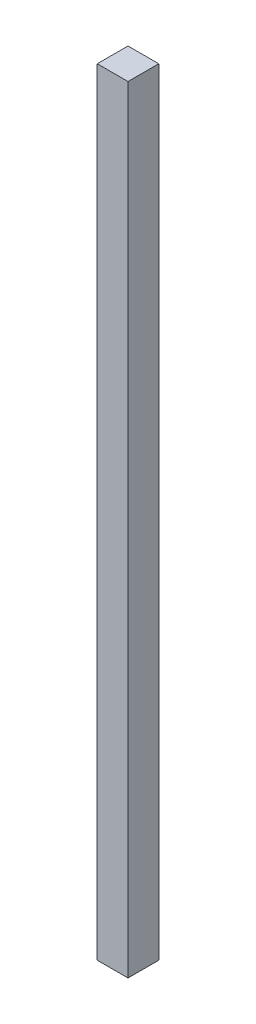
ISO-10303-21;
HEADER;
FILE_DESCRIPTION(('STEP AP214'),'2;1');
FILE_NAME('part.step','',(''),(''),'','','');
FILE_SCHEMA(('AUTOMOTIVE_DESIGN { 1 0 10303 214 1 1 1 1 }'));
ENDSEC;
DATA;
#1=APPLICATION_CONTEXT('core data for automotive mechanical design processes');
#2=APPLICATION_PROTOCOL_DEFINITION('international standard','automotive_design',2000,#1);
#3=PRODUCT_CONTEXT('',#1,'mechanical');
#4=PRODUCT('Part','Part','',(#3));
#5=PRODUCT_RELATED_PRODUCT_CATEGORY('part','',(#4));
#6=PRODUCT_DEFINITION_FORMATION('','',#4);
#7=PRODUCT_DEFINITION_CONTEXT('part definition',#1,'design');
#8=PRODUCT_DEFINITION('design','',#6,#7);
#9=PRODUCT_DEFINITION_SHAPE('','',#8);
#10=(LENGTH_UNIT() NAMED_UNIT(*) SI_UNIT(.MILLI.,.METRE.));
#11=(NAMED_UNIT(*) PLANE_ANGLE_UNIT() SI_UNIT($,.RADIAN.));
#12=(NAMED_UNIT(*) SI_UNIT($,.STERADIAN.) SOLID_ANGLE_UNIT());
#13=UNCERTAINTY_MEASURE_WITH_UNIT(LENGTH_MEASURE(1.E-05),#10,'distance_accuracy_value','');
#14=(GEOMETRIC_REPRESENTATION_CONTEXT(3) GLOBAL_UNCERTAINTY_ASSIGNED_CONTEXT((#13)) GLOBAL_UNIT_ASSIGNED_CONTEXT((#10,
#11,#12)) REPRESENTATION_CONTEXT('',''));
#15=CARTESIAN_POINT('',(0.,0.,0.));
#16=DIRECTION('',(0.,0.,1.));
#17=DIRECTION('',(1.,0.,0.));
#18=AXIS2_PLACEMENT_3D('',#15,#16,#17);
#19=CARTESIAN_POINT('',(38.1,1923.8,-38.1));
#20=DIRECTION('',(-1.,0.,0.));
#21=DIRECTION('',(0.,0.,1.));
#22=AXIS2_PLACEMENT_3D('',#19,#20,#21);
#23=PLANE('',#22);
#24=DIRECTION('',(0.,0.,-1.));
#25=VECTOR('',#24,1.);
#26=CARTESIAN_POINT('',(38.1,0.,-38.1));
#27=LINE('',#26,#25);
#28=CARTESIAN_POINT('',(38.1,0.,38.1));
#29=VERTEX_POINT('',#28);
#30=CARTESIAN_POINT('',(38.1,0.,-38.1));
#31=VERTEX_POINT('',#30);
#32=EDGE_CURVE('E107',#29,#31,#27,.T.);
#33=ORIENTED_EDGE('',*,*,#32,.T.);
#34=DIRECTION('',(0.,-1.,0.));
#35=VECTOR('',#34,1.);
#36=CARTESIAN_POINT('',(38.1,1923.8,-38.1));
#37=LINE('',#36,#35);
#38=CARTESIAN_POINT('',(38.1,1923.8,-38.1));
#39=VERTEX_POINT('',#38);
#40=EDGE_CURVE('E11',#39,#31,#37,.T.);
#41=ORIENTED_EDGE('',*,*,#40,.F.);
#42=DIRECTION('',(0.,0.,-1.));
#43=VECTOR('',#42,1.);
#44=CARTESIAN_POINT('',(38.1,1923.8,-38.1));
#45=LINE('',#44,#43);
#46=CARTESIAN_POINT('',(38.1,1923.8,38.1));
#47=VERTEX_POINT('',#46);
#48=EDGE_CURVE('E91',#47,#39,#45,.T.);
#49=ORIENTED_EDGE('',*,*,#48,.F.);
#50=DIRECTION('',(0.,-1.,0.));
#51=VECTOR('',#50,1.);
#52=CARTESIAN_POINT('',(38.1,1923.8,38.1));
#53=LINE('',#52,#51);
#54=EDGE_CURVE('E103',#47,#29,#53,.T.);
#55=ORIENTED_EDGE('',*,*,#54,.T.);
#56=EDGE_LOOP('',(#33,#41,#49,#55));
#57=FACE_BOUND('',#56,.T.);
#58=ADVANCED_FACE('F39',(#57),#23,.F.);
#59=CARTESIAN_POINT('',(-38.1,1923.8,-38.1));
#60=DIRECTION('',(0.,0.,1.));
#61=DIRECTION('',(1.,0.,0.));
#62=AXIS2_PLACEMENT_3D('',#59,#60,#61);
#63=PLANE('',#62);
#64=DIRECTION('',(-1.,0.,0.));
#65=VECTOR('',#64,1.);
#66=CARTESIAN_POINT('',(-38.1,0.,-38.1));
#67=LINE('',#66,#65);
#68=CARTESIAN_POINT('',(-38.1,0.,-38.1));
#69=VERTEX_POINT('',#68);
#70=EDGE_CURVE('E96',#31,#69,#67,.T.);
#71=ORIENTED_EDGE('',*,*,#70,.T.);
#72=DIRECTION('',(0.,-1.,0.));
#73=VECTOR('',#72,1.);
#74=CARTESIAN_POINT('',(-38.1,1923.8,-38.1));
#75=LINE('',#74,#73);
#76=CARTESIAN_POINT('',(-38.1,1923.8,-38.1));
#77=VERTEX_POINT('',#76);
#78=EDGE_CURVE('E48',#77,#69,#75,.T.);
#79=ORIENTED_EDGE('',*,*,#78,.F.);
#80=DIRECTION('',(-1.,0.,0.));
#81=VECTOR('',#80,1.);
#82=CARTESIAN_POINT('',(-38.1,1923.8,-38.1));
#83=LINE('',#82,#81);
#84=EDGE_CURVE('E86',#39,#77,#83,.T.);
#85=ORIENTED_EDGE('',*,*,#84,.F.);
#86=ORIENTED_EDGE('',*,*,#40,.T.);
#87=EDGE_LOOP('',(#71,#79,#85,#86));
#88=FACE_BOUND('',#87,.T.);
#89=ADVANCED_FACE('F95',(#88),#63,.F.);
#90=CARTESIAN_POINT('',(-38.1,1923.8,-38.1));
#91=DIRECTION('',(1.,0.,0.));
#92=DIRECTION('',(0.,0.,-1.));
#93=AXIS2_PLACEMENT_3D('',#90,#91,#92);
#94=PLANE('',#93);
#95=DIRECTION('',(0.,0.,1.));
#96=VECTOR('',#95,1.);
#97=CARTESIAN_POINT('',(-38.1,0.,-38.1));
#98=LINE('',#97,#96);
#99=CARTESIAN_POINT('',(-38.1,0.,38.1));
#100=VERTEX_POINT('',#99);
#101=EDGE_CURVE('E73',#69,#100,#98,.T.);
#102=ORIENTED_EDGE('',*,*,#101,.T.);
#103=DIRECTION('',(0.,-1.,0.));
#104=VECTOR('',#103,1.);
#105=CARTESIAN_POINT('',(-38.1,1923.8,38.1));
#106=LINE('',#105,#104);
#107=CARTESIAN_POINT('',(-38.1,1923.8,38.1));
#108=VERTEX_POINT('',#107);
#109=EDGE_CURVE('E98',#108,#100,#106,.T.);
#110=ORIENTED_EDGE('',*,*,#109,.F.);
#111=DIRECTION('',(0.,0.,1.));
#112=VECTOR('',#111,1.);
#113=CARTESIAN_POINT('',(-38.1,1923.8,-38.1));
#114=LINE('',#113,#112);
#115=EDGE_CURVE('E89',#77,#108,#114,.T.);
#116=ORIENTED_EDGE('',*,*,#115,.F.);
#117=ORIENTED_EDGE('',*,*,#78,.T.);
#118=EDGE_LOOP('',(#102,#110,#116,#117));
#119=FACE_BOUND('',#118,.T.);
#120=ADVANCED_FACE('F99',(#119),#94,.F.);
#121=CARTESIAN_POINT('',(-38.1,1923.8,38.1));
#122=DIRECTION('',(0.,0.,-1.));
#123=DIRECTION('',(-1.,0.,0.));
#124=AXIS2_PLACEMENT_3D('',#121,#122,#123);
#125=PLANE('',#124);
#126=DIRECTION('',(1.,0.,0.));
#127=VECTOR('',#126,1.);
#128=CARTESIAN_POINT('',(-38.1,0.,38.1));
#129=LINE('',#128,#127);
#130=EDGE_CURVE('E79',#100,#29,#129,.T.);
#131=ORIENTED_EDGE('',*,*,#130,.T.);
#132=ORIENTED_EDGE('',*,*,#54,.F.);
#133=DIRECTION('',(1.,0.,0.));
#134=VECTOR('',#133,1.);
#135=CARTESIAN_POINT('',(-38.1,1923.8,38.1));
#136=LINE('',#135,#134);
#137=EDGE_CURVE('E56',#108,#47,#136,.T.);
#138=ORIENTED_EDGE('',*,*,#137,.F.);
#139=ORIENTED_EDGE('',*,*,#109,.T.);
#140=EDGE_LOOP('',(#131,#132,#138,#139));
#141=FACE_BOUND('',#140,.T.);
#142=ADVANCED_FACE('F120',(#141),#125,.F.);
#143=CARTESIAN_POINT('',(0.,1923.8,0.));
#144=DIRECTION('',(0.,1.,0.));
#145=DIRECTION('',(0.,0.,1.));
#146=AXIS2_PLACEMENT_3D('',#143,#144,#145);
#147=PLANE('',#146);
#148=ORIENTED_EDGE('',*,*,#48,.T.);
#149=ORIENTED_EDGE('',*,*,#84,.T.);
#150=ORIENTED_EDGE('',*,*,#115,.T.);
#151=ORIENTED_EDGE('',*,*,#137,.T.);
#152=EDGE_LOOP('',(#148,#149,#150,#151));
#153=FACE_BOUND('',#152,.T.);
#154=ADVANCED_FACE('F87',(#153),#147,.T.);
#155=CARTESIAN_POINT('',(0.,0.,0.));
#156=DIRECTION('',(0.,1.,0.));
#157=DIRECTION('',(0.,0.,1.));
#158=AXIS2_PLACEMENT_3D('',#155,#156,#157);
#159=PLANE('',#158);
#160=ORIENTED_EDGE('',*,*,#32,.F.);
#161=ORIENTED_EDGE('',*,*,#130,.F.);
#162=ORIENTED_EDGE('',*,*,#101,.F.);
#163=ORIENTED_EDGE('',*,*,#70,.F.);
#164=EDGE_LOOP('',(#160,#161,#162,#163));
#165=FACE_BOUND('',#164,.T.);
#166=ADVANCED_FACE('F123',(#165),#159,.F.);
#167=CLOSED_SHELL('',(#58,#89,#120,#142,#154,#166));
#168=MANIFOLD_SOLID_BREP('B2',#167);
#169=ADVANCED_BREP_SHAPE_REPRESENTATION('',(#18,#168),#14);
#170=SHAPE_DEFINITION_REPRESENTATION(#9,#169);
ENDSEC;
END-ISO-10303-21;
